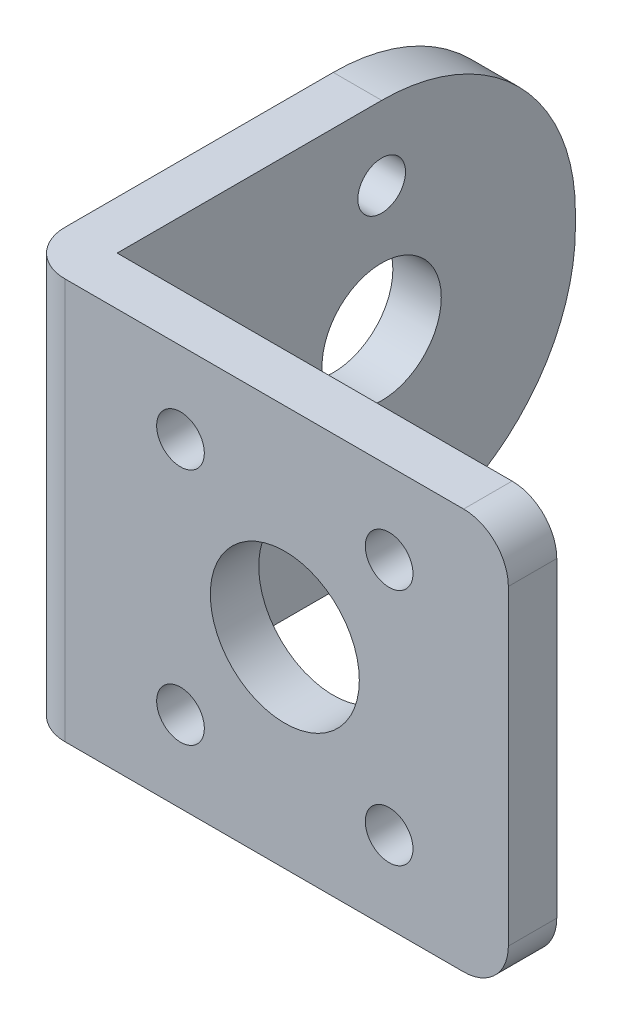
ISO-10303-21;
HEADER;
FILE_DESCRIPTION(('STEP AP214'),'2;1');
FILE_NAME('part.step','',(''),(''),'','','');
FILE_SCHEMA(('AUTOMOTIVE_DESIGN { 1 0 10303 214 1 1 1 1 }'));
ENDSEC;
DATA;
#1=APPLICATION_CONTEXT('core data for automotive mechanical design processes');
#2=APPLICATION_PROTOCOL_DEFINITION('international standard','automotive_design',2000,#1);
#3=PRODUCT_CONTEXT('',#1,'mechanical');
#4=PRODUCT('Part','Part','',(#3));
#5=PRODUCT_RELATED_PRODUCT_CATEGORY('part','',(#4));
#6=PRODUCT_DEFINITION_FORMATION('','',#4);
#7=PRODUCT_DEFINITION_CONTEXT('part definition',#1,'design');
#8=PRODUCT_DEFINITION('design','',#6,#7);
#9=PRODUCT_DEFINITION_SHAPE('','',#8);
#10=(LENGTH_UNIT() NAMED_UNIT(*) SI_UNIT(.MILLI.,.METRE.));
#11=(NAMED_UNIT(*) PLANE_ANGLE_UNIT() SI_UNIT($,.RADIAN.));
#12=(NAMED_UNIT(*) SI_UNIT($,.STERADIAN.) SOLID_ANGLE_UNIT());
#13=UNCERTAINTY_MEASURE_WITH_UNIT(LENGTH_MEASURE(1.E-05),#10,'distance_accuracy_value','');
#14=(GEOMETRIC_REPRESENTATION_CONTEXT(3) GLOBAL_UNCERTAINTY_ASSIGNED_CONTEXT((#13)) GLOBAL_UNIT_ASSIGNED_CONTEXT((#10,
#11,#12)) REPRESENTATION_CONTEXT('',''));
#15=CARTESIAN_POINT('',(0.,0.,0.));
#16=DIRECTION('',(0.,0.,1.));
#17=DIRECTION('',(1.,0.,0.));
#18=AXIS2_PLACEMENT_3D('',#15,#16,#17);
#19=CARTESIAN_POINT('',(0.,0.,3.25));
#20=DIRECTION('',(1.,0.,0.));
#21=DIRECTION('',(0.,0.,-1.));
#22=AXIS2_PLACEMENT_3D('',#19,#20,#21);
#23=PLANE('',#22);
#24=CARTESIAN_POINT('',(0.,21.95,-17.75));
#25=DIRECTION('',(1.,0.,0.));
#26=DIRECTION('',(0.,0.,-1.));
#27=AXIS2_PLACEMENT_3D('',#24,#25,#26);
#28=CIRCLE('',#27,1.6);
#29=CARTESIAN_POINT('',(0.,21.95,-19.35));
#30=VERTEX_POINT('',#29);
#31=EDGE_CURVE('E142',#30,#30,#28,.T.);
#32=ORIENTED_EDGE('',*,*,#31,.T.);
#33=EDGE_LOOP('',(#32));
#34=FACE_BOUND('',#33,.T.);
#35=CARTESIAN_POINT('',(0.,13.45,-17.75));
#36=DIRECTION('',(1.,0.,0.));
#37=DIRECTION('',(0.,0.,-1.));
#38=AXIS2_PLACEMENT_3D('',#35,#36,#37);
#39=CIRCLE('',#38,4.);
#40=CARTESIAN_POINT('',(0.,13.45,-21.75));
#41=VERTEX_POINT('',#40);
#42=EDGE_CURVE('E147',#41,#41,#39,.T.);
#43=ORIENTED_EDGE('',*,*,#42,.T.);
#44=EDGE_LOOP('',(#43));
#45=FACE_BOUND('',#44,.T.);
#46=CARTESIAN_POINT('',(0.,4.95,-17.75));
#47=DIRECTION('',(1.,0.,0.));
#48=DIRECTION('',(0.,0.,-1.));
#49=AXIS2_PLACEMENT_3D('',#46,#47,#48);
#50=CIRCLE('',#49,1.6);
#51=CARTESIAN_POINT('',(0.,4.95,-19.35));
#52=VERTEX_POINT('',#51);
#53=EDGE_CURVE('E337',#52,#52,#50,.T.);
#54=ORIENTED_EDGE('',*,*,#53,.T.);
#55=EDGE_LOOP('',(#54));
#56=FACE_BOUND('',#55,.T.);
#57=DIRECTION('',(0.,1.,0.));
#58=VECTOR('',#57,1.);
#59=CARTESIAN_POINT('',(0.,0.,-30.75));
#60=LINE('',#59,#58);
#61=CARTESIAN_POINT('',(0.,13.,-30.75));
#62=VERTEX_POINT('',#61);
#63=CARTESIAN_POINT('',(0.,13.9,-30.75));
#64=VERTEX_POINT('',#63);
#65=EDGE_CURVE('E141',#62,#64,#60,.T.);
#66=ORIENTED_EDGE('',*,*,#65,.F.);
#67=CARTESIAN_POINT('',(0.,13.,-17.75));
#68=DIRECTION('',(1.,0.,0.));
#69=DIRECTION('',(0.,0.,-1.));
#70=AXIS2_PLACEMENT_3D('',#67,#68,#69);
#71=CIRCLE('',#70,13.);
#72=CARTESIAN_POINT('',(0.,0.,-17.75));
#73=VERTEX_POINT('',#72);
#74=EDGE_CURVE('E232',#62,#73,#71,.F.);
#75=ORIENTED_EDGE('',*,*,#74,.T.);
#76=DIRECTION('',(0.,0.,-1.));
#77=VECTOR('',#76,1.);
#78=CARTESIAN_POINT('',(0.,0.,3.25));
#79=LINE('',#78,#77);
#80=CARTESIAN_POINT('',(0.,0.,0.250000000000001));
#81=VERTEX_POINT('',#80);
#82=EDGE_CURVE('E196',#81,#73,#79,.T.);
#83=ORIENTED_EDGE('',*,*,#82,.F.);
#84=DIRECTION('',(0.,-1.,0.));
#85=VECTOR('',#84,1.);
#86=CARTESIAN_POINT('',(0.,0.,0.25));
#87=LINE('',#86,#85);
#88=CARTESIAN_POINT('',(0.,26.9,0.250000000000001));
#89=VERTEX_POINT('',#88);
#90=EDGE_CURVE('E220',#81,#89,#87,.F.);
#91=ORIENTED_EDGE('',*,*,#90,.T.);
#92=DIRECTION('',(0.,0.,-1.));
#93=VECTOR('',#92,1.);
#94=CARTESIAN_POINT('',(0.,26.9,3.25));
#95=LINE('',#94,#93);
#96=CARTESIAN_POINT('',(0.,26.9,-17.75));
#97=VERTEX_POINT('',#96);
#98=EDGE_CURVE('E189',#89,#97,#95,.T.);
#99=ORIENTED_EDGE('',*,*,#98,.T.);
#100=CARTESIAN_POINT('',(0.,13.9,-17.75));
#101=DIRECTION('',(1.,0.,0.));
#102=DIRECTION('',(0.,0.,-1.));
#103=AXIS2_PLACEMENT_3D('',#100,#101,#102);
#104=CIRCLE('',#103,13.);
#105=EDGE_CURVE('E230',#97,#64,#104,.F.);
#106=ORIENTED_EDGE('',*,*,#105,.T.);
#107=EDGE_LOOP('',(#66,#75,#83,#91,#99,#106));
#108=FACE_BOUND('',#107,.T.);
#109=ADVANCED_FACE('F36',(#34,#45,#56,#108),#23,.F.);
#110=CARTESIAN_POINT('',(0.,0.,3.25));
#111=DIRECTION('',(0.,1.,0.));
#112=DIRECTION('',(0.,0.,1.));
#113=AXIS2_PLACEMENT_3D('',#110,#111,#112);
#114=PLANE('',#113);
#115=ORIENTED_EDGE('',*,*,#82,.T.);
#116=DIRECTION('',(-1.,0.,0.));
#117=VECTOR('',#116,1.);
#118=CARTESIAN_POINT('',(3.25,0.,-17.75));
#119=LINE('',#118,#117);
#120=CARTESIAN_POINT('',(3.25,0.,-17.75));
#121=VERTEX_POINT('',#120);
#122=EDGE_CURVE('E59',#73,#121,#119,.F.);
#123=ORIENTED_EDGE('',*,*,#122,.T.);
#124=DIRECTION('',(0.,0.,1.));
#125=VECTOR('',#124,1.);
#126=CARTESIAN_POINT('',(3.25,0.,-30.75));
#127=LINE('',#126,#125);
#128=CARTESIAN_POINT('',(3.25,0.,0.));
#129=VERTEX_POINT('',#128);
#130=EDGE_CURVE('E116',#121,#129,#127,.T.);
#131=ORIENTED_EDGE('',*,*,#130,.T.);
#132=DIRECTION('',(1.,0.,0.));
#133=VECTOR('',#132,1.);
#134=CARTESIAN_POINT('',(0.,0.,0.));
#135=LINE('',#134,#133);
#136=CARTESIAN_POINT('',(29.75,0.,0.));
#137=VERTEX_POINT('',#136);
#138=EDGE_CURVE('E120',#129,#137,#135,.T.);
#139=ORIENTED_EDGE('',*,*,#138,.T.);
#140=DIRECTION('',(0.,0.,-1.));
#141=VECTOR('',#140,1.);
#142=CARTESIAN_POINT('',(29.75,0.,3.25));
#143=LINE('',#142,#141);
#144=CARTESIAN_POINT('',(29.75,0.,3.25));
#145=VERTEX_POINT('',#144);
#146=EDGE_CURVE('E206',#137,#145,#143,.F.);
#147=ORIENTED_EDGE('',*,*,#146,.T.);
#148=DIRECTION('',(1.,0.,0.));
#149=VECTOR('',#148,1.);
#150=CARTESIAN_POINT('',(0.,0.,3.25));
#151=LINE('',#150,#149);
#152=CARTESIAN_POINT('',(3.,0.,3.25));
#153=VERTEX_POINT('',#152);
#154=EDGE_CURVE('E181',#153,#145,#151,.T.);
#155=ORIENTED_EDGE('',*,*,#154,.F.);
#156=CARTESIAN_POINT('',(3.,0.,0.25));
#157=DIRECTION('',(0.,1.,0.));
#158=DIRECTION('',(0.,0.,1.));
#159=AXIS2_PLACEMENT_3D('',#156,#157,#158);
#160=CIRCLE('',#159,3.);
#161=EDGE_CURVE('E218',#153,#81,#160,.F.);
#162=ORIENTED_EDGE('',*,*,#161,.T.);
#163=EDGE_LOOP('',(#115,#123,#131,#139,#147,#155,#162));
#164=FACE_BOUND('',#163,.T.);
#165=ADVANCED_FACE('F118',(#164),#114,.F.);
#166=CARTESIAN_POINT('',(32.75,0.,3.25));
#167=DIRECTION('',(-1.,0.,0.));
#168=DIRECTION('',(0.,0.,1.));
#169=AXIS2_PLACEMENT_3D('',#166,#167,#168);
#170=PLANE('',#169);
#171=DIRECTION('',(0.,1.,0.));
#172=VECTOR('',#171,1.);
#173=CARTESIAN_POINT('',(32.75,0.,3.25));
#174=LINE('',#173,#172);
#175=CARTESIAN_POINT('',(32.75,3.,3.25));
#176=VERTEX_POINT('',#175);
#177=CARTESIAN_POINT('',(32.75,23.9,3.25));
#178=VERTEX_POINT('',#177);
#179=EDGE_CURVE('E183',#176,#178,#174,.T.);
#180=ORIENTED_EDGE('',*,*,#179,.F.);
#181=DIRECTION('',(0.,0.,-1.));
#182=VECTOR('',#181,1.);
#183=CARTESIAN_POINT('',(32.75,3.,3.25));
#184=LINE('',#183,#182);
#185=CARTESIAN_POINT('',(32.75,3.,0.));
#186=VERTEX_POINT('',#185);
#187=EDGE_CURVE('E200',#176,#186,#184,.T.);
#188=ORIENTED_EDGE('',*,*,#187,.T.);
#189=DIRECTION('',(0.,1.,0.));
#190=VECTOR('',#189,1.);
#191=CARTESIAN_POINT('',(32.75,0.,0.));
#192=LINE('',#191,#190);
#193=CARTESIAN_POINT('',(32.75,23.9,0.));
#194=VERTEX_POINT('',#193);
#195=EDGE_CURVE('E137',#186,#194,#192,.T.);
#196=ORIENTED_EDGE('',*,*,#195,.T.);
#197=DIRECTION('',(0.,0.,-1.));
#198=VECTOR('',#197,1.);
#199=CARTESIAN_POINT('',(32.75,23.9,3.25));
#200=LINE('',#199,#198);
#201=EDGE_CURVE('E198',#194,#178,#200,.F.);
#202=ORIENTED_EDGE('',*,*,#201,.T.);
#203=EDGE_LOOP('',(#180,#188,#196,#202));
#204=FACE_BOUND('',#203,.T.);
#205=ADVANCED_FACE('F264',(#204),#170,.F.);
#206=CARTESIAN_POINT('',(0.,26.9,3.25));
#207=DIRECTION('',(0.,-1.,0.));
#208=DIRECTION('',(0.,0.,-1.));
#209=AXIS2_PLACEMENT_3D('',#206,#207,#208);
#210=PLANE('',#209);
#211=DIRECTION('',(0.,0.,1.));
#212=VECTOR('',#211,1.);
#213=CARTESIAN_POINT('',(3.25,26.9,-30.75));
#214=LINE('',#213,#212);
#215=CARTESIAN_POINT('',(3.25,26.9,-17.75));
#216=VERTEX_POINT('',#215);
#217=CARTESIAN_POINT('',(3.25,26.9,0.));
#218=VERTEX_POINT('',#217);
#219=EDGE_CURVE('E124',#216,#218,#214,.T.);
#220=ORIENTED_EDGE('',*,*,#219,.F.);
#221=DIRECTION('',(1.,0.,0.));
#222=VECTOR('',#221,1.);
#223=CARTESIAN_POINT('',(0.,26.9,-17.75));
#224=LINE('',#223,#222);
#225=EDGE_CURVE('E11',#216,#97,#224,.F.);
#226=ORIENTED_EDGE('',*,*,#225,.T.);
#227=ORIENTED_EDGE('',*,*,#98,.F.);
#228=CARTESIAN_POINT('',(3.,26.9,0.25));
#229=DIRECTION('',(0.,-1.,0.));
#230=DIRECTION('',(0.,0.,-1.));
#231=AXIS2_PLACEMENT_3D('',#228,#229,#230);
#232=CIRCLE('',#231,3.);
#233=CARTESIAN_POINT('',(3.,26.9,3.25));
#234=VERTEX_POINT('',#233);
#235=EDGE_CURVE('E222',#89,#234,#232,.F.);
#236=ORIENTED_EDGE('',*,*,#235,.T.);
#237=DIRECTION('',(-1.,0.,0.));
#238=VECTOR('',#237,1.);
#239=CARTESIAN_POINT('',(0.,26.9,3.25));
#240=LINE('',#239,#238);
#241=CARTESIAN_POINT('',(29.75,26.9,3.25));
#242=VERTEX_POINT('',#241);
#243=EDGE_CURVE('E187',#242,#234,#240,.T.);
#244=ORIENTED_EDGE('',*,*,#243,.F.);
#245=DIRECTION('',(0.,0.,-1.));
#246=VECTOR('',#245,1.);
#247=CARTESIAN_POINT('',(29.75,26.9,3.25));
#248=LINE('',#247,#246);
#249=CARTESIAN_POINT('',(29.75,26.9,0.));
#250=VERTEX_POINT('',#249);
#251=EDGE_CURVE('E212',#242,#250,#248,.T.);
#252=ORIENTED_EDGE('',*,*,#251,.T.);
#253=DIRECTION('',(-1.,0.,0.));
#254=VECTOR('',#253,1.);
#255=CARTESIAN_POINT('',(0.,26.9,0.));
#256=LINE('',#255,#254);
#257=EDGE_CURVE('E184',#250,#218,#256,.T.);
#258=ORIENTED_EDGE('',*,*,#257,.T.);
#259=EDGE_LOOP('',(#220,#226,#227,#236,#244,#252,#258));
#260=FACE_BOUND('',#259,.T.);
#261=ADVANCED_FACE('F257',(#260),#210,.F.);
#262=CARTESIAN_POINT('',(0.,0.,3.25));
#263=DIRECTION('',(0.,0.,-1.));
#264=DIRECTION('',(-1.,0.,0.));
#265=AXIS2_PLACEMENT_3D('',#262,#263,#264);
#266=PLANE('',#265);
#267=CARTESIAN_POINT('',(10.75,5.45,3.25));
#268=DIRECTION('',(0.,0.,1.));
#269=DIRECTION('',(1.,0.,0.));
#270=AXIS2_PLACEMENT_3D('',#267,#268,#269);
#271=CIRCLE('',#270,1.6);
#272=CARTESIAN_POINT('',(12.35,5.45,3.25));
#273=VERTEX_POINT('',#272);
#274=EDGE_CURVE('E172',#273,#273,#271,.T.);
#275=ORIENTED_EDGE('',*,*,#274,.F.);
#276=EDGE_LOOP('',(#275));
#277=FACE_BOUND('',#276,.T.);
#278=CARTESIAN_POINT('',(24.75,5.45,3.25));
#279=DIRECTION('',(0.,0.,1.));
#280=DIRECTION('',(1.,0.,0.));
#281=AXIS2_PLACEMENT_3D('',#278,#279,#280);
#282=CIRCLE('',#281,1.6);
#283=CARTESIAN_POINT('',(26.35,5.45,3.25));
#284=VERTEX_POINT('',#283);
#285=EDGE_CURVE('E166',#284,#284,#282,.T.);
#286=ORIENTED_EDGE('',*,*,#285,.F.);
#287=EDGE_LOOP('',(#286));
#288=FACE_BOUND('',#287,.T.);
#289=CARTESIAN_POINT('',(24.75,21.45,3.25));
#290=DIRECTION('',(0.,0.,1.));
#291=DIRECTION('',(1.,0.,0.));
#292=AXIS2_PLACEMENT_3D('',#289,#290,#291);
#293=CIRCLE('',#292,1.6);
#294=CARTESIAN_POINT('',(26.35,21.45,3.25));
#295=VERTEX_POINT('',#294);
#296=EDGE_CURVE('E160',#295,#295,#293,.T.);
#297=ORIENTED_EDGE('',*,*,#296,.F.);
#298=EDGE_LOOP('',(#297));
#299=FACE_BOUND('',#298,.T.);
#300=CARTESIAN_POINT('',(17.75,13.45,3.25));
#301=DIRECTION('',(0.,0.,1.));
#302=DIRECTION('',(1.,0.,0.));
#303=AXIS2_PLACEMENT_3D('',#300,#301,#302);
#304=CIRCLE('',#303,5.);
#305=CARTESIAN_POINT('',(22.75,13.45,3.25));
#306=VERTEX_POINT('',#305);
#307=EDGE_CURVE('E153',#306,#306,#304,.T.);
#308=ORIENTED_EDGE('',*,*,#307,.F.);
#309=EDGE_LOOP('',(#308));
#310=FACE_BOUND('',#309,.T.);
#311=CARTESIAN_POINT('',(10.75,21.45,3.25));
#312=DIRECTION('',(0.,0.,1.));
#313=DIRECTION('',(1.,0.,0.));
#314=AXIS2_PLACEMENT_3D('',#311,#312,#313);
#315=CIRCLE('',#314,1.6);
#316=CARTESIAN_POINT('',(12.35,21.45,3.25));
#317=VERTEX_POINT('',#316);
#318=EDGE_CURVE('E156',#317,#317,#315,.T.);
#319=ORIENTED_EDGE('',*,*,#318,.F.);
#320=EDGE_LOOP('',(#319));
#321=FACE_BOUND('',#320,.T.);
#322=ORIENTED_EDGE('',*,*,#243,.T.);
#323=DIRECTION('',(0.,-1.,0.));
#324=VECTOR('',#323,1.);
#325=CARTESIAN_POINT('',(3.,0.,3.25));
#326=LINE('',#325,#324);
#327=EDGE_CURVE('E215',#234,#153,#326,.T.);
#328=ORIENTED_EDGE('',*,*,#327,.T.);
#329=ORIENTED_EDGE('',*,*,#154,.T.);
#330=CARTESIAN_POINT('',(29.75,3.,3.25));
#331=DIRECTION('',(0.,0.,-1.));
#332=DIRECTION('',(-1.,0.,0.));
#333=AXIS2_PLACEMENT_3D('',#330,#331,#332);
#334=CIRCLE('',#333,3.);
#335=EDGE_CURVE('E210',#145,#176,#334,.F.);
#336=ORIENTED_EDGE('',*,*,#335,.T.);
#337=ORIENTED_EDGE('',*,*,#179,.T.);
#338=CARTESIAN_POINT('',(29.75,23.9,3.25));
#339=DIRECTION('',(0.,0.,-1.));
#340=DIRECTION('',(-1.,0.,0.));
#341=AXIS2_PLACEMENT_3D('',#338,#339,#340);
#342=CIRCLE('',#341,3.);
#343=EDGE_CURVE('E208',#178,#242,#342,.F.);
#344=ORIENTED_EDGE('',*,*,#343,.T.);
#345=EDGE_LOOP('',(#322,#328,#329,#336,#337,#344));
#346=FACE_BOUND('',#345,.T.);
#347=ADVANCED_FACE('F252',(#277,#288,#299,#310,#321,#346),#266,.F.);
#348=CARTESIAN_POINT('',(0.,0.,0.));
#349=DIRECTION('',(0.,0.,-1.));
#350=DIRECTION('',(-1.,0.,0.));
#351=AXIS2_PLACEMENT_3D('',#348,#349,#350);
#352=PLANE('',#351);
#353=DIRECTION('',(0.,-1.,0.));
#354=VECTOR('',#353,1.);
#355=CARTESIAN_POINT('',(3.25,0.,0.));
#356=LINE('',#355,#354);
#357=EDGE_CURVE('E132',#218,#129,#356,.T.);
#358=ORIENTED_EDGE('',*,*,#357,.F.);
#359=ORIENTED_EDGE('',*,*,#257,.F.);
#360=CARTESIAN_POINT('',(29.75,23.9,0.));
#361=DIRECTION('',(0.,0.,-1.));
#362=DIRECTION('',(-1.,0.,0.));
#363=AXIS2_PLACEMENT_3D('',#360,#361,#362);
#364=CIRCLE('',#363,3.);
#365=EDGE_CURVE('E203',#250,#194,#364,.T.);
#366=ORIENTED_EDGE('',*,*,#365,.T.);
#367=ORIENTED_EDGE('',*,*,#195,.F.);
#368=CARTESIAN_POINT('',(29.75,3.,0.));
#369=DIRECTION('',(0.,0.,-1.));
#370=DIRECTION('',(-1.,0.,0.));
#371=AXIS2_PLACEMENT_3D('',#368,#369,#370);
#372=CIRCLE('',#371,3.);
#373=EDGE_CURVE('E135',#186,#137,#372,.T.);
#374=ORIENTED_EDGE('',*,*,#373,.T.);
#375=ORIENTED_EDGE('',*,*,#138,.F.);
#376=EDGE_LOOP('',(#358,#359,#366,#367,#374,#375));
#377=FACE_BOUND('',#376,.T.);
#378=CARTESIAN_POINT('',(10.75,5.45,0.));
#379=DIRECTION('',(0.,0.,1.));
#380=DIRECTION('',(1.,0.,0.));
#381=AXIS2_PLACEMENT_3D('',#378,#379,#380);
#382=CIRCLE('',#381,1.6);
#383=CARTESIAN_POINT('',(12.35,5.45,0.));
#384=VERTEX_POINT('',#383);
#385=EDGE_CURVE('E152',#384,#384,#382,.T.);
#386=ORIENTED_EDGE('',*,*,#385,.T.);
#387=EDGE_LOOP('',(#386));
#388=FACE_BOUND('',#387,.T.);
#389=CARTESIAN_POINT('',(24.75,5.45,0.));
#390=DIRECTION('',(0.,0.,1.));
#391=DIRECTION('',(1.,0.,0.));
#392=AXIS2_PLACEMENT_3D('',#389,#390,#391);
#393=CIRCLE('',#392,1.6);
#394=CARTESIAN_POINT('',(26.35,5.45,0.));
#395=VERTEX_POINT('',#394);
#396=EDGE_CURVE('E169',#395,#395,#393,.T.);
#397=ORIENTED_EDGE('',*,*,#396,.T.);
#398=EDGE_LOOP('',(#397));
#399=FACE_BOUND('',#398,.T.);
#400=CARTESIAN_POINT('',(24.75,21.45,0.));
#401=DIRECTION('',(0.,0.,1.));
#402=DIRECTION('',(1.,0.,0.));
#403=AXIS2_PLACEMENT_3D('',#400,#401,#402);
#404=CIRCLE('',#403,1.6);
#405=CARTESIAN_POINT('',(26.35,21.45,0.));
#406=VERTEX_POINT('',#405);
#407=EDGE_CURVE('E163',#406,#406,#404,.T.);
#408=ORIENTED_EDGE('',*,*,#407,.T.);
#409=EDGE_LOOP('',(#408));
#410=FACE_BOUND('',#409,.T.);
#411=CARTESIAN_POINT('',(17.75,13.45,0.));
#412=DIRECTION('',(0.,0.,1.));
#413=DIRECTION('',(1.,0.,0.));
#414=AXIS2_PLACEMENT_3D('',#411,#412,#413);
#415=CIRCLE('',#414,5.);
#416=CARTESIAN_POINT('',(22.75,13.45,0.));
#417=VERTEX_POINT('',#416);
#418=EDGE_CURVE('E157',#417,#417,#415,.T.);
#419=ORIENTED_EDGE('',*,*,#418,.T.);
#420=EDGE_LOOP('',(#419));
#421=FACE_BOUND('',#420,.T.);
#422=CARTESIAN_POINT('',(10.75,21.45,0.));
#423=DIRECTION('',(0.,0.,1.));
#424=DIRECTION('',(1.,0.,0.));
#425=AXIS2_PLACEMENT_3D('',#422,#423,#424);
#426=CIRCLE('',#425,1.6);
#427=CARTESIAN_POINT('',(12.35,21.45,0.));
#428=VERTEX_POINT('',#427);
#429=EDGE_CURVE('E138',#428,#428,#426,.T.);
#430=ORIENTED_EDGE('',*,*,#429,.T.);
#431=EDGE_LOOP('',(#430));
#432=FACE_BOUND('',#431,.T.);
#433=ADVANCED_FACE('F129',(#377,#388,#399,#410,#421,#432),#352,.T.);
#434=CARTESIAN_POINT('',(29.75,3.,3.25));
#435=DIRECTION('',(0.,0.,-1.));
#436=DIRECTION('',(-1.,0.,0.));
#437=AXIS2_PLACEMENT_3D('',#434,#435,#436);
#438=CYLINDRICAL_SURFACE('',#437,3.);
#439=ORIENTED_EDGE('',*,*,#335,.F.);
#440=ORIENTED_EDGE('',*,*,#146,.F.);
#441=ORIENTED_EDGE('',*,*,#373,.F.);
#442=ORIENTED_EDGE('',*,*,#187,.F.);
#443=EDGE_LOOP('',(#439,#440,#441,#442));
#444=FACE_BOUND('',#443,.T.);
#445=ADVANCED_FACE('F268',(#444),#438,.T.);
#446=CARTESIAN_POINT('',(29.75,23.9,3.25));
#447=DIRECTION('',(0.,0.,-1.));
#448=DIRECTION('',(-1.,0.,0.));
#449=AXIS2_PLACEMENT_3D('',#446,#447,#448);
#450=CYLINDRICAL_SURFACE('',#449,3.);
#451=ORIENTED_EDGE('',*,*,#343,.F.);
#452=ORIENTED_EDGE('',*,*,#201,.F.);
#453=ORIENTED_EDGE('',*,*,#365,.F.);
#454=ORIENTED_EDGE('',*,*,#251,.F.);
#455=EDGE_LOOP('',(#451,#452,#453,#454));
#456=FACE_BOUND('',#455,.T.);
#457=ADVANCED_FACE('F260',(#456),#450,.T.);
#458=CARTESIAN_POINT('',(10.75,21.45,0.));
#459=DIRECTION('',(0.,0.,1.));
#460=DIRECTION('',(1.,0.,0.));
#461=AXIS2_PLACEMENT_3D('',#458,#459,#460);
#462=CYLINDRICAL_SURFACE('',#461,1.6);
#463=ORIENTED_EDGE('',*,*,#429,.F.);
#464=EDGE_LOOP('',(#463));
#465=FACE_BOUND('',#464,.T.);
#466=ORIENTED_EDGE('',*,*,#318,.T.);
#467=EDGE_LOOP('',(#466));
#468=FACE_BOUND('',#467,.T.);
#469=ADVANCED_FACE('F275',(#465,#468),#462,.F.);
#470=CARTESIAN_POINT('',(17.75,13.45,0.));
#471=DIRECTION('',(0.,0.,1.));
#472=DIRECTION('',(1.,0.,0.));
#473=AXIS2_PLACEMENT_3D('',#470,#471,#472);
#474=CYLINDRICAL_SURFACE('',#473,5.);
#475=ORIENTED_EDGE('',*,*,#418,.F.);
#476=EDGE_LOOP('',(#475));
#477=FACE_BOUND('',#476,.T.);
#478=ORIENTED_EDGE('',*,*,#307,.T.);
#479=EDGE_LOOP('',(#478));
#480=FACE_BOUND('',#479,.T.);
#481=ADVANCED_FACE('F296',(#477,#480),#474,.F.);
#482=CARTESIAN_POINT('',(24.75,21.45,0.));
#483=DIRECTION('',(0.,0.,1.));
#484=DIRECTION('',(1.,0.,0.));
#485=AXIS2_PLACEMENT_3D('',#482,#483,#484);
#486=CYLINDRICAL_SURFACE('',#485,1.6);
#487=ORIENTED_EDGE('',*,*,#407,.F.);
#488=EDGE_LOOP('',(#487));
#489=FACE_BOUND('',#488,.T.);
#490=ORIENTED_EDGE('',*,*,#296,.T.);
#491=EDGE_LOOP('',(#490));
#492=FACE_BOUND('',#491,.T.);
#493=ADVANCED_FACE('F305',(#489,#492),#486,.F.);
#494=CARTESIAN_POINT('',(24.75,5.45,0.));
#495=DIRECTION('',(0.,0.,1.));
#496=DIRECTION('',(1.,0.,0.));
#497=AXIS2_PLACEMENT_3D('',#494,#495,#496);
#498=CYLINDRICAL_SURFACE('',#497,1.6);
#499=ORIENTED_EDGE('',*,*,#396,.F.);
#500=EDGE_LOOP('',(#499));
#501=FACE_BOUND('',#500,.T.);
#502=ORIENTED_EDGE('',*,*,#285,.T.);
#503=EDGE_LOOP('',(#502));
#504=FACE_BOUND('',#503,.T.);
#505=ADVANCED_FACE('F301',(#501,#504),#498,.F.);
#506=CARTESIAN_POINT('',(10.75,5.45,0.));
#507=DIRECTION('',(0.,0.,1.));
#508=DIRECTION('',(1.,0.,0.));
#509=AXIS2_PLACEMENT_3D('',#506,#507,#508);
#510=CYLINDRICAL_SURFACE('',#509,1.6);
#511=ORIENTED_EDGE('',*,*,#385,.F.);
#512=EDGE_LOOP('',(#511));
#513=FACE_BOUND('',#512,.T.);
#514=ORIENTED_EDGE('',*,*,#274,.T.);
#515=EDGE_LOOP('',(#514));
#516=FACE_BOUND('',#515,.T.);
#517=ADVANCED_FACE('F298',(#513,#516),#510,.F.);
#518=CARTESIAN_POINT('',(3.25,0.,-30.75));
#519=DIRECTION('',(-1.,0.,0.));
#520=DIRECTION('',(0.,0.,1.));
#521=AXIS2_PLACEMENT_3D('',#518,#519,#520);
#522=PLANE('',#521);
#523=CARTESIAN_POINT('',(3.25,21.95,-17.75));
#524=DIRECTION('',(1.,0.,0.));
#525=DIRECTION('',(0.,0.,-1.));
#526=AXIS2_PLACEMENT_3D('',#523,#524,#525);
#527=CIRCLE('',#526,1.6);
#528=CARTESIAN_POINT('',(3.25,21.95,-19.35));
#529=VERTEX_POINT('',#528);
#530=EDGE_CURVE('E335',#529,#529,#527,.T.);
#531=ORIENTED_EDGE('',*,*,#530,.F.);
#532=EDGE_LOOP('',(#531));
#533=FACE_BOUND('',#532,.T.);
#534=CARTESIAN_POINT('',(3.25,13.45,-17.75));
#535=DIRECTION('',(1.,0.,0.));
#536=DIRECTION('',(0.,0.,-1.));
#537=AXIS2_PLACEMENT_3D('',#534,#535,#536);
#538=CIRCLE('',#537,4.);
#539=CARTESIAN_POINT('',(3.25,13.45,-21.75));
#540=VERTEX_POINT('',#539);
#541=EDGE_CURVE('E338',#540,#540,#538,.T.);
#542=ORIENTED_EDGE('',*,*,#541,.F.);
#543=EDGE_LOOP('',(#542));
#544=FACE_BOUND('',#543,.T.);
#545=CARTESIAN_POINT('',(3.25,4.95,-17.75));
#546=DIRECTION('',(1.,0.,0.));
#547=DIRECTION('',(0.,0.,-1.));
#548=AXIS2_PLACEMENT_3D('',#545,#546,#547);
#549=CIRCLE('',#548,1.6);
#550=CARTESIAN_POINT('',(3.25,4.95,-19.35));
#551=VERTEX_POINT('',#550);
#552=EDGE_CURVE('E343',#551,#551,#549,.T.);
#553=ORIENTED_EDGE('',*,*,#552,.F.);
#554=EDGE_LOOP('',(#553));
#555=FACE_BOUND('',#554,.T.);
#556=ORIENTED_EDGE('',*,*,#130,.F.);
#557=CARTESIAN_POINT('',(3.25,13.,-17.75));
#558=DIRECTION('',(-1.,0.,0.));
#559=DIRECTION('',(0.,0.,1.));
#560=AXIS2_PLACEMENT_3D('',#557,#558,#559);
#561=CIRCLE('',#560,13.);
#562=CARTESIAN_POINT('',(3.25,13.,-30.75));
#563=VERTEX_POINT('',#562);
#564=EDGE_CURVE('E44',#121,#563,#561,.F.);
#565=ORIENTED_EDGE('',*,*,#564,.T.);
#566=DIRECTION('',(0.,-1.,0.));
#567=VECTOR('',#566,1.);
#568=CARTESIAN_POINT('',(3.25,0.,-30.75));
#569=LINE('',#568,#567);
#570=CARTESIAN_POINT('',(3.25,13.9,-30.75));
#571=VERTEX_POINT('',#570);
#572=EDGE_CURVE('E125',#571,#563,#569,.T.);
#573=ORIENTED_EDGE('',*,*,#572,.F.);
#574=CARTESIAN_POINT('',(3.25,13.9,-17.75));
#575=DIRECTION('',(-1.,0.,0.));
#576=DIRECTION('',(0.,0.,1.));
#577=AXIS2_PLACEMENT_3D('',#574,#575,#576);
#578=CIRCLE('',#577,13.);
#579=EDGE_CURVE('E51',#571,#216,#578,.F.);
#580=ORIENTED_EDGE('',*,*,#579,.T.);
#581=ORIENTED_EDGE('',*,*,#219,.T.);
#582=ORIENTED_EDGE('',*,*,#357,.T.);
#583=EDGE_LOOP('',(#556,#565,#573,#580,#581,#582));
#584=FACE_BOUND('',#583,.T.);
#585=ADVANCED_FACE('F140',(#533,#544,#555,#584),#522,.F.);
#586=CARTESIAN_POINT('',(0.,0.,-30.75));
#587=DIRECTION('',(0.,0.,-1.));
#588=DIRECTION('',(-1.,0.,0.));
#589=AXIS2_PLACEMENT_3D('',#586,#587,#588);
#590=PLANE('',#589);
#591=ORIENTED_EDGE('',*,*,#572,.T.);
#592=DIRECTION('',(-1.,0.,0.));
#593=VECTOR('',#592,1.);
#594=CARTESIAN_POINT('',(0.,13.,-30.75));
#595=LINE('',#594,#593);
#596=EDGE_CURVE('E227',#563,#62,#595,.T.);
#597=ORIENTED_EDGE('',*,*,#596,.T.);
#598=ORIENTED_EDGE('',*,*,#65,.T.);
#599=DIRECTION('',(1.,0.,0.));
#600=VECTOR('',#599,1.);
#601=CARTESIAN_POINT('',(3.25,13.9,-30.75));
#602=LINE('',#601,#600);
#603=EDGE_CURVE('E224',#64,#571,#602,.T.);
#604=ORIENTED_EDGE('',*,*,#603,.T.);
#605=EDGE_LOOP('',(#591,#597,#598,#604));
#606=FACE_BOUND('',#605,.T.);
#607=ADVANCED_FACE('F239',(#606),#590,.T.);
#608=CARTESIAN_POINT('',(3.,0.,0.25));
#609=DIRECTION('',(0.,-1.,0.));
#610=DIRECTION('',(0.,0.,-1.));
#611=AXIS2_PLACEMENT_3D('',#608,#609,#610);
#612=CYLINDRICAL_SURFACE('',#611,3.);
#613=ORIENTED_EDGE('',*,*,#235,.F.);
#614=ORIENTED_EDGE('',*,*,#90,.F.);
#615=ORIENTED_EDGE('',*,*,#161,.F.);
#616=ORIENTED_EDGE('',*,*,#327,.F.);
#617=EDGE_LOOP('',(#613,#614,#615,#616));
#618=FACE_BOUND('',#617,.T.);
#619=ADVANCED_FACE('F250',(#618),#612,.T.);
#620=CARTESIAN_POINT('',(-27.5,4.95,-17.75));
#621=DIRECTION('',(1.,0.,0.));
#622=DIRECTION('',(0.,0.,-1.));
#623=AXIS2_PLACEMENT_3D('',#620,#621,#622);
#624=CYLINDRICAL_SURFACE('',#623,1.6);
#625=ORIENTED_EDGE('',*,*,#552,.T.);
#626=EDGE_LOOP('',(#625));
#627=FACE_BOUND('',#626,.T.);
#628=ORIENTED_EDGE('',*,*,#53,.F.);
#629=EDGE_LOOP('',(#628));
#630=FACE_BOUND('',#629,.T.);
#631=ADVANCED_FACE('F318',(#627,#630),#624,.F.);
#632=CARTESIAN_POINT('',(-27.5,13.45,-17.75));
#633=DIRECTION('',(1.,0.,0.));
#634=DIRECTION('',(0.,0.,-1.));
#635=AXIS2_PLACEMENT_3D('',#632,#633,#634);
#636=CYLINDRICAL_SURFACE('',#635,4.);
#637=ORIENTED_EDGE('',*,*,#541,.T.);
#638=EDGE_LOOP('',(#637));
#639=FACE_BOUND('',#638,.T.);
#640=ORIENTED_EDGE('',*,*,#42,.F.);
#641=EDGE_LOOP('',(#640));
#642=FACE_BOUND('',#641,.T.);
#643=ADVANCED_FACE('F321',(#639,#642),#636,.F.);
#644=CARTESIAN_POINT('',(-27.5,21.95,-17.75));
#645=DIRECTION('',(1.,0.,0.));
#646=DIRECTION('',(0.,0.,-1.));
#647=AXIS2_PLACEMENT_3D('',#644,#645,#646);
#648=CYLINDRICAL_SURFACE('',#647,1.6);
#649=ORIENTED_EDGE('',*,*,#530,.T.);
#650=EDGE_LOOP('',(#649));
#651=FACE_BOUND('',#650,.T.);
#652=ORIENTED_EDGE('',*,*,#31,.F.);
#653=EDGE_LOOP('',(#652));
#654=FACE_BOUND('',#653,.T.);
#655=ADVANCED_FACE('F325',(#651,#654),#648,.F.);
#656=CARTESIAN_POINT('',(0.,13.,-17.75));
#657=DIRECTION('',(1.,0.,0.));
#658=DIRECTION('',(0.,0.,-1.));
#659=AXIS2_PLACEMENT_3D('',#656,#657,#658);
#660=CYLINDRICAL_SURFACE('',#659,13.);
#661=ORIENTED_EDGE('',*,*,#564,.F.);
#662=ORIENTED_EDGE('',*,*,#122,.F.);
#663=ORIENTED_EDGE('',*,*,#74,.F.);
#664=ORIENTED_EDGE('',*,*,#596,.F.);
#665=EDGE_LOOP('',(#661,#662,#663,#664));
#666=FACE_BOUND('',#665,.T.);
#667=ADVANCED_FACE('F242',(#666),#660,.T.);
#668=CARTESIAN_POINT('',(0.,13.9,-17.75));
#669=DIRECTION('',(-1.,0.,0.));
#670=DIRECTION('',(0.,0.,1.));
#671=AXIS2_PLACEMENT_3D('',#668,#669,#670);
#672=CYLINDRICAL_SURFACE('',#671,13.);
#673=ORIENTED_EDGE('',*,*,#105,.F.);
#674=ORIENTED_EDGE('',*,*,#225,.F.);
#675=ORIENTED_EDGE('',*,*,#579,.F.);
#676=ORIENTED_EDGE('',*,*,#603,.F.);
#677=EDGE_LOOP('',(#673,#674,#675,#676));
#678=FACE_BOUND('',#677,.T.);
#679=ADVANCED_FACE('F38',(#678),#672,.T.);
#680=CLOSED_SHELL('',(#109,#165,#205,#261,#347,#433,#445,#457,#469,#481,#493,#505,#517,#585,
#607,#619,#631,#643,#655,#667,#679));
#681=MANIFOLD_SOLID_BREP('B2',#680);
#682=ADVANCED_BREP_SHAPE_REPRESENTATION('',(#18,#681),#14);
#683=SHAPE_DEFINITION_REPRESENTATION(#9,#682);
ENDSEC;
END-ISO-10303-21;
